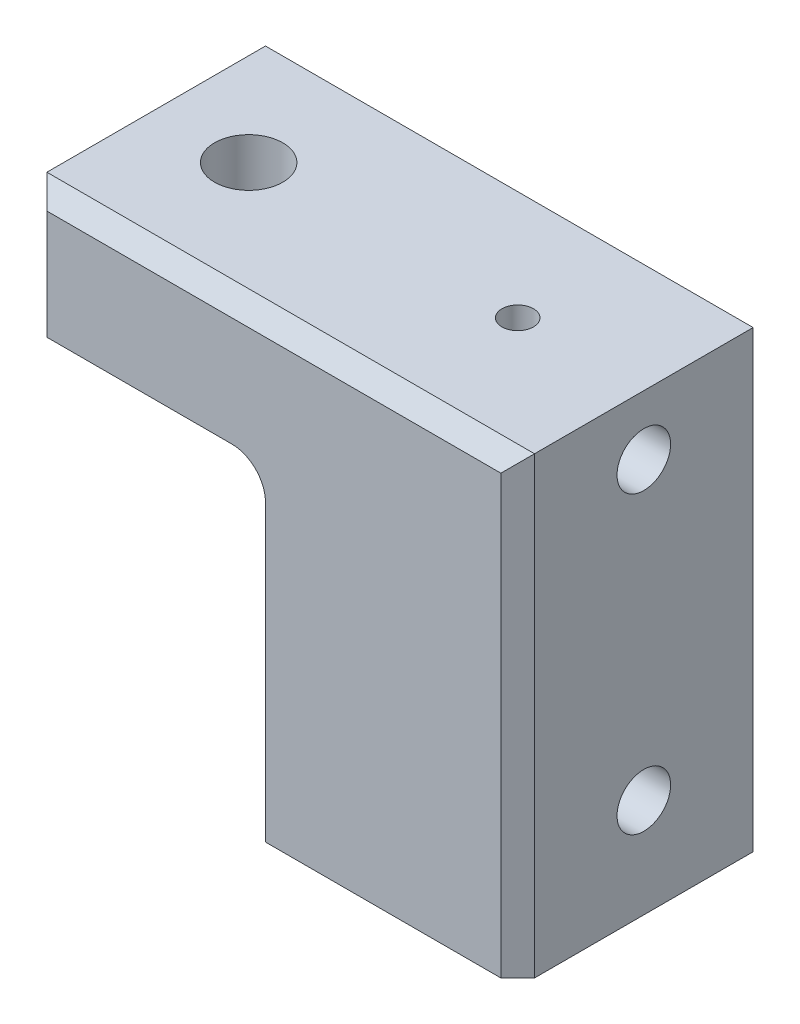
ISO-10303-21;
HEADER;
FILE_DESCRIPTION(('STEP AP214'),'2;1');
FILE_NAME('part.step','',(''),(''),'','','');
FILE_SCHEMA(('AUTOMOTIVE_DESIGN { 1 0 10303 214 1 1 1 1 }'));
ENDSEC;
DATA;
#1=APPLICATION_CONTEXT('core data for automotive mechanical design processes');
#2=APPLICATION_PROTOCOL_DEFINITION('international standard','automotive_design',2000,#1);
#3=PRODUCT_CONTEXT('',#1,'mechanical');
#4=PRODUCT('Part','Part','',(#3));
#5=PRODUCT_RELATED_PRODUCT_CATEGORY('part','',(#4));
#6=PRODUCT_DEFINITION_FORMATION('','',#4);
#7=PRODUCT_DEFINITION_CONTEXT('part definition',#1,'design');
#8=PRODUCT_DEFINITION('design','',#6,#7);
#9=PRODUCT_DEFINITION_SHAPE('','',#8);
#10=(LENGTH_UNIT() NAMED_UNIT(*) SI_UNIT(.MILLI.,.METRE.));
#11=(NAMED_UNIT(*) PLANE_ANGLE_UNIT() SI_UNIT($,.RADIAN.));
#12=(NAMED_UNIT(*) SI_UNIT($,.STERADIAN.) SOLID_ANGLE_UNIT());
#13=UNCERTAINTY_MEASURE_WITH_UNIT(LENGTH_MEASURE(1.E-05),#10,'distance_accuracy_value','');
#14=(GEOMETRIC_REPRESENTATION_CONTEXT(3) GLOBAL_UNCERTAINTY_ASSIGNED_CONTEXT((#13)) GLOBAL_UNIT_ASSIGNED_CONTEXT((#10,
#11,#12)) REPRESENTATION_CONTEXT('',''));
#15=CARTESIAN_POINT('',(0.,0.,0.));
#16=DIRECTION('',(0.,0.,1.));
#17=DIRECTION('',(1.,0.,0.));
#18=AXIS2_PLACEMENT_3D('',#15,#16,#17);
#19=CARTESIAN_POINT('',(-38.1,49.53,38.1));
#20=DIRECTION('',(0.,1.,0.));
#21=DIRECTION('',(0.,0.,1.));
#22=AXIS2_PLACEMENT_3D('',#19,#20,#21);
#23=PLANE('',#22);
#24=CARTESIAN_POINT('',(-59.69,49.53,19.05));
#25=DIRECTION('',(0.,1.,0.));
#26=DIRECTION('',(0.,0.,1.));
#27=AXIS2_PLACEMENT_3D('',#24,#25,#26);
#28=CIRCLE('',#27,5.15873999999998);
#29=CARTESIAN_POINT('',(-59.69,49.53,24.20874));
#30=VERTEX_POINT('',#29);
#31=EDGE_CURVE('E159',#30,#30,#28,.T.);
#32=ORIENTED_EDGE('',*,*,#31,.T.);
#33=EDGE_LOOP('',(#32));
#34=FACE_BOUND('',#33,.T.);
#35=DIRECTION('',(0.,0.,-1.));
#36=VECTOR('',#35,1.);
#37=CARTESIAN_POINT('',(-73.66,49.53,38.1));
#38=LINE('',#37,#36);
#39=CARTESIAN_POINT('',(-73.66,49.53,35.56));
#40=VERTEX_POINT('',#39);
#41=CARTESIAN_POINT('',(-73.66,49.53,2.54));
#42=VERTEX_POINT('',#41);
#43=EDGE_CURVE('E170',#40,#42,#38,.T.);
#44=ORIENTED_EDGE('',*,*,#43,.T.);
#45=DIRECTION('',(0.707106781186549,0.,-0.707106781186546));
#46=VECTOR('',#45,1.);
#47=CARTESIAN_POINT('',(-73.66,49.53,2.54));
#48=LINE('',#47,#46);
#49=CARTESIAN_POINT('',(-71.12,49.53,0.));
#50=VERTEX_POINT('',#49);
#51=EDGE_CURVE('E208',#42,#50,#48,.T.);
#52=ORIENTED_EDGE('',*,*,#51,.T.);
#53=DIRECTION('',(1.,0.,0.));
#54=VECTOR('',#53,1.);
#55=CARTESIAN_POINT('',(-38.1,49.53,0.));
#56=LINE('',#55,#54);
#57=CARTESIAN_POINT('',(-43.18,49.53,0.));
#58=VERTEX_POINT('',#57);
#59=EDGE_CURVE('E162',#50,#58,#56,.T.);
#60=ORIENTED_EDGE('',*,*,#59,.T.);
#61=DIRECTION('',(0.,0.,-1.));
#62=VECTOR('',#61,1.);
#63=CARTESIAN_POINT('',(-43.18,49.53,38.1));
#64=LINE('',#63,#62);
#65=CARTESIAN_POINT('',(-43.18,49.53,38.1));
#66=VERTEX_POINT('',#65);
#67=EDGE_CURVE('E193',#58,#66,#64,.F.);
#68=ORIENTED_EDGE('',*,*,#67,.T.);
#69=DIRECTION('',(1.,0.,0.));
#70=VECTOR('',#69,1.);
#71=CARTESIAN_POINT('',(-38.1,49.53,38.1));
#72=LINE('',#71,#70);
#73=CARTESIAN_POINT('',(-71.12,49.53,38.1));
#74=VERTEX_POINT('',#73);
#75=EDGE_CURVE('E163',#74,#66,#72,.T.);
#76=ORIENTED_EDGE('',*,*,#75,.F.);
#77=DIRECTION('',(0.707106781186546,0.,0.707106781186549));
#78=VECTOR('',#77,1.);
#79=CARTESIAN_POINT('',(-71.12,49.53,38.1));
#80=LINE('',#79,#78);
#81=EDGE_CURVE('E206',#74,#40,#80,.F.);
#82=ORIENTED_EDGE('',*,*,#81,.T.);
#83=EDGE_LOOP('',(#44,#52,#60,#68,#76,#82));
#84=FACE_BOUND('',#83,.T.);
#85=ADVANCED_FACE('F44',(#34,#84),#23,.F.);
#86=CARTESIAN_POINT('',(-38.1,0.,38.1));
#87=DIRECTION('',(1.,0.,0.));
#88=DIRECTION('',(0.,0.,-1.));
#89=AXIS2_PLACEMENT_3D('',#86,#87,#88);
#90=PLANE('',#89);
#91=CARTESIAN_POINT('',(-38.1,14.986,19.05));
#92=DIRECTION('',(1.,0.,0.));
#93=DIRECTION('',(0.,0.,-1.));
#94=AXIS2_PLACEMENT_3D('',#91,#92,#93);
#95=CIRCLE('',#94,3.37819999999999);
#96=CARTESIAN_POINT('',(-38.1,14.986,15.6718));
#97=VERTEX_POINT('',#96);
#98=EDGE_CURVE('E140',#97,#97,#95,.T.);
#99=ORIENTED_EDGE('',*,*,#98,.T.);
#100=EDGE_LOOP('',(#99));
#101=FACE_BOUND('',#100,.T.);
#102=DIRECTION('',(0.,-1.,0.));
#103=VECTOR('',#102,1.);
#104=CARTESIAN_POINT('',(-38.1,0.,38.1));
#105=LINE('',#104,#103);
#106=CARTESIAN_POINT('',(-38.1,44.45,38.1));
#107=VERTEX_POINT('',#106);
#108=CARTESIAN_POINT('',(-38.1,0.,38.1));
#109=VERTEX_POINT('',#108);
#110=EDGE_CURVE('E165',#107,#109,#105,.T.);
#111=ORIENTED_EDGE('',*,*,#110,.F.);
#112=DIRECTION('',(0.,0.,-1.));
#113=VECTOR('',#112,1.);
#114=CARTESIAN_POINT('',(-38.1,44.45,0.));
#115=LINE('',#114,#113);
#116=CARTESIAN_POINT('',(-38.1,44.45,0.));
#117=VERTEX_POINT('',#116);
#118=EDGE_CURVE('E189',#107,#117,#115,.T.);
#119=ORIENTED_EDGE('',*,*,#118,.T.);
#120=DIRECTION('',(0.,-1.,0.));
#121=VECTOR('',#120,1.);
#122=CARTESIAN_POINT('',(-38.1,0.,0.));
#123=LINE('',#122,#121);
#124=CARTESIAN_POINT('',(-38.1,0.,0.));
#125=VERTEX_POINT('',#124);
#126=EDGE_CURVE('E172',#117,#125,#123,.T.);
#127=ORIENTED_EDGE('',*,*,#126,.T.);
#128=DIRECTION('',(0.,0.,-1.));
#129=VECTOR('',#128,1.);
#130=CARTESIAN_POINT('',(-38.1,0.,38.1));
#131=LINE('',#130,#129);
#132=EDGE_CURVE('E187',#109,#125,#131,.T.);
#133=ORIENTED_EDGE('',*,*,#132,.F.);
#134=EDGE_LOOP('',(#111,#119,#127,#133));
#135=FACE_BOUND('',#134,.T.);
#136=ADVANCED_FACE('F298',(#101,#135),#90,.F.);
#137=CARTESIAN_POINT('',(0.,0.,38.1));
#138=DIRECTION('',(0.,1.,0.));
#139=DIRECTION('',(-1.,0.,0.));
#140=AXIS2_PLACEMENT_3D('',#137,#138,#139);
#141=PLANE('',#140);
#142=DIRECTION('',(1.,0.,0.));
#143=VECTOR('',#142,1.);
#144=CARTESIAN_POINT('',(0.,0.,0.));
#145=LINE('',#144,#143);
#146=CARTESIAN_POINT('',(-2.54000000000001,0.,0.));
#147=VERTEX_POINT('',#146);
#148=EDGE_CURVE('E166',#125,#147,#145,.T.);
#149=ORIENTED_EDGE('',*,*,#148,.T.);
#150=DIRECTION('',(0.707106781186549,0.,0.707106781186546));
#151=VECTOR('',#150,1.);
#152=CARTESIAN_POINT('',(0.,0.,2.54));
#153=LINE('',#152,#151);
#154=CARTESIAN_POINT('',(0.,0.,2.54000000000001));
#155=VERTEX_POINT('',#154);
#156=EDGE_CURVE('E222',#147,#155,#153,.T.);
#157=ORIENTED_EDGE('',*,*,#156,.T.);
#158=DIRECTION('',(0.,0.,-1.));
#159=VECTOR('',#158,1.);
#160=CARTESIAN_POINT('',(0.,0.,38.1));
#161=LINE('',#160,#159);
#162=CARTESIAN_POINT('',(0.,0.,35.56));
#163=VERTEX_POINT('',#162);
#164=EDGE_CURVE('E184',#163,#155,#161,.T.);
#165=ORIENTED_EDGE('',*,*,#164,.F.);
#166=DIRECTION('',(0.707106781186546,0.,-0.70710678118655));
#167=VECTOR('',#166,1.);
#168=CARTESIAN_POINT('',(-2.54,0.,38.1));
#169=LINE('',#168,#167);
#170=CARTESIAN_POINT('',(-2.54,0.,38.1));
#171=VERTEX_POINT('',#170);
#172=EDGE_CURVE('E220',#163,#171,#169,.F.);
#173=ORIENTED_EDGE('',*,*,#172,.T.);
#174=DIRECTION('',(1.,0.,0.));
#175=VECTOR('',#174,1.);
#176=CARTESIAN_POINT('',(0.,0.,38.1));
#177=LINE('',#176,#175);
#178=EDGE_CURVE('E168',#109,#171,#177,.T.);
#179=ORIENTED_EDGE('',*,*,#178,.F.);
#180=ORIENTED_EDGE('',*,*,#132,.T.);
#181=EDGE_LOOP('',(#149,#157,#165,#173,#179,#180));
#182=FACE_BOUND('',#181,.T.);
#183=ADVANCED_FACE('F254',(#182),#141,.F.);
#184=CARTESIAN_POINT('',(0.,68.58,38.1));
#185=DIRECTION('',(-1.,0.,0.));
#186=DIRECTION('',(0.,-1.,0.));
#187=AXIS2_PLACEMENT_3D('',#184,#185,#186);
#188=PLANE('',#187);
#189=CARTESIAN_POINT('',(0.,14.986,19.05));
#190=DIRECTION('',(1.,0.,0.));
#191=DIRECTION('',(0.,0.,-1.));
#192=AXIS2_PLACEMENT_3D('',#189,#190,#191);
#193=CIRCLE('',#192,4.04748999999999);
#194=CARTESIAN_POINT('',(0.,14.986,15.00251));
#195=VERTEX_POINT('',#194);
#196=EDGE_CURVE('E146',#195,#195,#193,.T.);
#197=ORIENTED_EDGE('',*,*,#196,.F.);
#198=EDGE_LOOP('',(#197));
#199=FACE_BOUND('',#198,.T.);
#200=CARTESIAN_POINT('',(1.2490009027033E-13,59.563,19.05));
#201=DIRECTION('',(1.,0.,0.));
#202=DIRECTION('',(0.,0.,-1.));
#203=AXIS2_PLACEMENT_3D('',#200,#201,#202);
#204=CIRCLE('',#203,4.04749000000004);
#205=CARTESIAN_POINT('',(1.2490009027033E-13,59.563,15.00251));
#206=VERTEX_POINT('',#205);
#207=EDGE_CURVE('E153',#206,#206,#204,.T.);
#208=ORIENTED_EDGE('',*,*,#207,.F.);
#209=EDGE_LOOP('',(#208));
#210=FACE_BOUND('',#209,.T.);
#211=ORIENTED_EDGE('',*,*,#164,.T.);
#212=DIRECTION('',(0.,1.,0.));
#213=VECTOR('',#212,1.);
#214=CARTESIAN_POINT('',(0.,68.58,2.54));
#215=LINE('',#214,#213);
#216=CARTESIAN_POINT('',(0.,68.58,2.54000000000001));
#217=VERTEX_POINT('',#216);
#218=EDGE_CURVE('E218',#155,#217,#215,.T.);
#219=ORIENTED_EDGE('',*,*,#218,.T.);
#220=DIRECTION('',(0.,0.,-1.));
#221=VECTOR('',#220,1.);
#222=CARTESIAN_POINT('',(0.,68.58,38.1));
#223=LINE('',#222,#221);
#224=CARTESIAN_POINT('',(0.,68.58,35.56));
#225=VERTEX_POINT('',#224);
#226=EDGE_CURVE('E181',#225,#217,#223,.T.);
#227=ORIENTED_EDGE('',*,*,#226,.F.);
#228=DIRECTION('',(0.,-1.,0.));
#229=VECTOR('',#228,1.);
#230=CARTESIAN_POINT('',(0.,68.58,35.56));
#231=LINE('',#230,#229);
#232=EDGE_CURVE('E216',#225,#163,#231,.T.);
#233=ORIENTED_EDGE('',*,*,#232,.T.);
#234=EDGE_LOOP('',(#211,#219,#227,#233));
#235=FACE_BOUND('',#234,.T.);
#236=ADVANCED_FACE('F251',(#199,#210,#235),#188,.F.);
#237=CARTESIAN_POINT('',(-73.66,68.58,38.1));
#238=DIRECTION('',(0.,-1.,0.));
#239=DIRECTION('',(0.,0.,-1.));
#240=AXIS2_PLACEMENT_3D('',#237,#238,#239);
#241=PLANE('',#240);
#242=CARTESIAN_POINT('',(-19.05,68.58,19.05));
#243=DIRECTION('',(0.,1.,0.));
#244=DIRECTION('',(0.,0.,1.));
#245=AXIS2_PLACEMENT_3D('',#242,#243,#244);
#246=CIRCLE('',#245,2.38124999999999);
#247=CARTESIAN_POINT('',(-19.05,68.58,21.43125));
#248=VERTEX_POINT('',#247);
#249=EDGE_CURVE('E235',#248,#248,#246,.T.);
#250=ORIENTED_EDGE('',*,*,#249,.F.);
#251=EDGE_LOOP('',(#250));
#252=FACE_BOUND('',#251,.T.);
#253=CARTESIAN_POINT('',(-59.69,68.58,19.05));
#254=DIRECTION('',(0.,1.,0.));
#255=DIRECTION('',(0.,0.,1.));
#256=AXIS2_PLACEMENT_3D('',#253,#254,#255);
#257=CIRCLE('',#256,5.15873999999999);
#258=CARTESIAN_POINT('',(-59.69,68.58,24.20874));
#259=VERTEX_POINT('',#258);
#260=EDGE_CURVE('E156',#259,#259,#257,.T.);
#261=ORIENTED_EDGE('',*,*,#260,.F.);
#262=EDGE_LOOP('',(#261));
#263=FACE_BOUND('',#262,.T.);
#264=ORIENTED_EDGE('',*,*,#226,.T.);
#265=DIRECTION('',(-1.,0.,0.));
#266=VECTOR('',#265,1.);
#267=CARTESIAN_POINT('',(-73.66,68.58,2.54));
#268=LINE('',#267,#266);
#269=CARTESIAN_POINT('',(-73.66,68.58,2.54000000000001));
#270=VERTEX_POINT('',#269);
#271=EDGE_CURVE('E226',#217,#270,#268,.T.);
#272=ORIENTED_EDGE('',*,*,#271,.T.);
#273=DIRECTION('',(0.,0.,-1.));
#274=VECTOR('',#273,1.);
#275=CARTESIAN_POINT('',(-73.66,68.58,38.1));
#276=LINE('',#275,#274);
#277=CARTESIAN_POINT('',(-73.66,68.58,35.56));
#278=VERTEX_POINT('',#277);
#279=EDGE_CURVE('E178',#278,#270,#276,.T.);
#280=ORIENTED_EDGE('',*,*,#279,.F.);
#281=DIRECTION('',(1.,0.,0.));
#282=VECTOR('',#281,1.);
#283=CARTESIAN_POINT('',(-73.66,68.58,35.56));
#284=LINE('',#283,#282);
#285=EDGE_CURVE('E224',#278,#225,#284,.T.);
#286=ORIENTED_EDGE('',*,*,#285,.T.);
#287=EDGE_LOOP('',(#264,#272,#280,#286));
#288=FACE_BOUND('',#287,.T.);
#289=ADVANCED_FACE('F264',(#252,#263,#288),#241,.F.);
#290=CARTESIAN_POINT('',(-73.66,49.53,38.1));
#291=DIRECTION('',(1.,0.,0.));
#292=DIRECTION('',(0.,0.,-1.));
#293=AXIS2_PLACEMENT_3D('',#290,#291,#292);
#294=PLANE('',#293);
#295=ORIENTED_EDGE('',*,*,#279,.T.);
#296=DIRECTION('',(0.,-1.,0.));
#297=VECTOR('',#296,1.);
#298=CARTESIAN_POINT('',(-73.66,49.53,2.54));
#299=LINE('',#298,#297);
#300=EDGE_CURVE('E203',#270,#42,#299,.T.);
#301=ORIENTED_EDGE('',*,*,#300,.T.);
#302=ORIENTED_EDGE('',*,*,#43,.F.);
#303=DIRECTION('',(0.,1.,0.));
#304=VECTOR('',#303,1.);
#305=CARTESIAN_POINT('',(-73.66,49.53,35.56));
#306=LINE('',#305,#304);
#307=EDGE_CURVE('E201',#40,#278,#306,.T.);
#308=ORIENTED_EDGE('',*,*,#307,.T.);
#309=EDGE_LOOP('',(#295,#301,#302,#308));
#310=FACE_BOUND('',#309,.T.);
#311=ADVANCED_FACE('F268',(#310),#294,.F.);
#312=CARTESIAN_POINT('',(-73.66,49.53,38.1));
#313=DIRECTION('',(0.,0.,-1.));
#314=DIRECTION('',(-1.,0.,0.));
#315=AXIS2_PLACEMENT_3D('',#312,#313,#314);
#316=PLANE('',#315);
#317=DIRECTION('',(-1.,0.,0.));
#318=VECTOR('',#317,1.);
#319=CARTESIAN_POINT('',(-73.66,66.04,38.1));
#320=LINE('',#319,#318);
#321=CARTESIAN_POINT('',(-2.54,66.04,38.1));
#322=VERTEX_POINT('',#321);
#323=CARTESIAN_POINT('',(-71.12,66.04,38.1));
#324=VERTEX_POINT('',#323);
#325=EDGE_CURVE('E60',#322,#324,#320,.T.);
#326=ORIENTED_EDGE('',*,*,#325,.T.);
#327=DIRECTION('',(0.,-1.,0.));
#328=VECTOR('',#327,1.);
#329=CARTESIAN_POINT('',(-71.12,49.53,38.1));
#330=LINE('',#329,#328);
#331=EDGE_CURVE('E13',#324,#74,#330,.T.);
#332=ORIENTED_EDGE('',*,*,#331,.T.);
#333=ORIENTED_EDGE('',*,*,#75,.T.);
#334=CARTESIAN_POINT('',(-43.18,44.45,38.1));
#335=DIRECTION('',(0.,0.,-1.));
#336=DIRECTION('',(-1.,0.,0.));
#337=AXIS2_PLACEMENT_3D('',#334,#335,#336);
#338=CIRCLE('',#337,5.08);
#339=EDGE_CURVE('E199',#66,#107,#338,.T.);
#340=ORIENTED_EDGE('',*,*,#339,.T.);
#341=ORIENTED_EDGE('',*,*,#110,.T.);
#342=ORIENTED_EDGE('',*,*,#178,.T.);
#343=DIRECTION('',(0.,1.,0.));
#344=VECTOR('',#343,1.);
#345=CARTESIAN_POINT('',(-2.54,49.53,38.1));
#346=LINE('',#345,#344);
#347=EDGE_CURVE('E53',#171,#322,#346,.T.);
#348=ORIENTED_EDGE('',*,*,#347,.T.);
#349=EDGE_LOOP('',(#326,#332,#333,#340,#341,#342,#348));
#350=FACE_BOUND('',#349,.T.);
#351=ADVANCED_FACE('F288',(#350),#316,.F.);
#352=CARTESIAN_POINT('',(-73.66,49.53,0.));
#353=DIRECTION('',(0.,0.,-1.));
#354=DIRECTION('',(-1.,0.,0.));
#355=AXIS2_PLACEMENT_3D('',#352,#353,#354);
#356=PLANE('',#355);
#357=ORIENTED_EDGE('',*,*,#59,.F.);
#358=DIRECTION('',(0.,1.,0.));
#359=VECTOR('',#358,1.);
#360=CARTESIAN_POINT('',(-71.12,68.58,0.));
#361=LINE('',#360,#359);
#362=CARTESIAN_POINT('',(-71.12,66.04,0.));
#363=VERTEX_POINT('',#362);
#364=EDGE_CURVE('E214',#50,#363,#361,.T.);
#365=ORIENTED_EDGE('',*,*,#364,.T.);
#366=DIRECTION('',(1.,0.,0.));
#367=VECTOR('',#366,1.);
#368=CARTESIAN_POINT('',(0.,66.04,0.));
#369=LINE('',#368,#367);
#370=CARTESIAN_POINT('',(-2.54000000000001,66.04,0.));
#371=VERTEX_POINT('',#370);
#372=EDGE_CURVE('E210',#363,#371,#369,.T.);
#373=ORIENTED_EDGE('',*,*,#372,.T.);
#374=DIRECTION('',(0.,-1.,0.));
#375=VECTOR('',#374,1.);
#376=CARTESIAN_POINT('',(-2.54000000000001,0.,0.));
#377=LINE('',#376,#375);
#378=EDGE_CURVE('E212',#371,#147,#377,.T.);
#379=ORIENTED_EDGE('',*,*,#378,.T.);
#380=ORIENTED_EDGE('',*,*,#148,.F.);
#381=ORIENTED_EDGE('',*,*,#126,.F.);
#382=CARTESIAN_POINT('',(-43.18,44.45,0.));
#383=DIRECTION('',(0.,0.,-1.));
#384=DIRECTION('',(-1.,0.,0.));
#385=AXIS2_PLACEMENT_3D('',#382,#383,#384);
#386=CIRCLE('',#385,5.08);
#387=EDGE_CURVE('E196',#117,#58,#386,.F.);
#388=ORIENTED_EDGE('',*,*,#387,.T.);
#389=EDGE_LOOP('',(#357,#365,#373,#379,#380,#381,#388));
#390=FACE_BOUND('',#389,.T.);
#391=ADVANCED_FACE('F280',(#390),#356,.T.);
#392=CARTESIAN_POINT('',(-59.69,68.58,19.05));
#393=DIRECTION('',(0.,1.,0.));
#394=DIRECTION('',(0.,0.,1.));
#395=AXIS2_PLACEMENT_3D('',#392,#393,#394);
#396=CYLINDRICAL_SURFACE('',#395,5.15873999999998);
#397=ORIENTED_EDGE('',*,*,#260,.T.);
#398=EDGE_LOOP('',(#397));
#399=FACE_BOUND('',#398,.T.);
#400=ORIENTED_EDGE('',*,*,#31,.F.);
#401=EDGE_LOOP('',(#400));
#402=FACE_BOUND('',#401,.T.);
#403=ADVANCED_FACE('F355',(#399,#402),#396,.F.);
#404=CARTESIAN_POINT('',(0.,59.563,19.05));
#405=DIRECTION('',(1.,0.,0.));
#406=DIRECTION('',(0.,0.,-1.));
#407=AXIS2_PLACEMENT_3D('',#404,#405,#406);
#408=CYLINDRICAL_SURFACE('',#407,4.04749000000004);
#409=CARTESIAN_POINT('',(-15.7479999999999,59.563,19.05));
#410=DIRECTION('',(1.,0.,0.));
#411=DIRECTION('',(0.,0.,-1.));
#412=AXIS2_PLACEMENT_3D('',#409,#410,#411);
#413=CIRCLE('',#412,4.04749000000004);
#414=CARTESIAN_POINT('',(-15.7479999999999,59.563,15.00251));
#415=VERTEX_POINT('',#414);
#416=EDGE_CURVE('E143',#415,#415,#413,.T.);
#417=ORIENTED_EDGE('',*,*,#416,.F.);
#418=EDGE_LOOP('',(#417));
#419=FACE_BOUND('',#418,.T.);
#420=ORIENTED_EDGE('',*,*,#207,.T.);
#421=EDGE_LOOP('',(#420));
#422=FACE_BOUND('',#421,.T.);
#423=ADVANCED_FACE('F352',(#419,#422),#408,.F.);
#424=CARTESIAN_POINT('',(-15.7479999999999,62.9412,19.05));
#425=DIRECTION('',(-1.,0.,0.));
#426=DIRECTION('',(0.,0.,1.));
#427=AXIS2_PLACEMENT_3D('',#424,#425,#426);
#428=PLANE('',#427);
#429=CARTESIAN_POINT('',(-15.748,59.563,19.05));
#430=DIRECTION('',(1.,0.,0.));
#431=DIRECTION('',(0.,0.,-1.));
#432=AXIS2_PLACEMENT_3D('',#429,#430,#431);
#433=CIRCLE('',#432,3.37819999999999);
#434=CARTESIAN_POINT('',(-15.748,59.563,15.6718));
#435=VERTEX_POINT('',#434);
#436=EDGE_CURVE('E139',#435,#435,#433,.T.);
#437=ORIENTED_EDGE('',*,*,#436,.F.);
#438=EDGE_LOOP('',(#437));
#439=FACE_BOUND('',#438,.T.);
#440=ORIENTED_EDGE('',*,*,#416,.T.);
#441=EDGE_LOOP('',(#440));
#442=FACE_BOUND('',#441,.T.);
#443=ADVANCED_FACE('F354',(#439,#442),#428,.F.);
#444=CARTESIAN_POINT('',(0.,59.563,19.05));
#445=DIRECTION('',(1.,0.,0.));
#446=DIRECTION('',(0.,0.,-1.));
#447=AXIS2_PLACEMENT_3D('',#444,#445,#446);
#448=CYLINDRICAL_SURFACE('',#447,3.37819999999999);
#449=CARTESIAN_POINT('',(-19.05,61.9592227937944,21.43125));
#450=CARTESIAN_POINT('',(-18.9359868720826,61.9592280928064,21.431247477135));
#451=CARTESIAN_POINT('',(-18.8219608591508,61.9675212767405,21.422985201558));
#452=CARTESIAN_POINT('',(-18.598157196441,61.9989098730898,21.3907359462089));
#453=CARTESIAN_POINT('',(-18.4883898728869,62.0220391375964,21.3667130018088));
#454=CARTESIAN_POINT('',(-18.2772067330058,62.0787138089649,21.3050235198922));
#455=CARTESIAN_POINT('',(-18.1757109006721,62.1121391924891,21.2675134022336));
#456=CARTESIAN_POINT('',(-17.980697616419,62.185425615349,21.1803433569552));
#457=CARTESIAN_POINT('',(-17.8871804649329,62.2252868968622,21.1306829720952));
#458=CARTESIAN_POINT('',(-17.6925339542891,62.3154310921772,21.0103461912306));
#459=CARTESIAN_POINT('',(-17.5930173985083,62.3663053893881,20.9375017660292));
#460=CARTESIAN_POINT('',(-17.4061852598383,62.4678010302935,20.7772544034519));
#461=CARTESIAN_POINT('',(-17.318885323687,62.5184219709583,20.6898331046531));
#462=CARTESIAN_POINT('',(-17.144121913988,62.6238169107056,20.4849215150611));
#463=CARTESIAN_POINT('',(-17.059151996863,62.677834696879,20.3648459902898));
#464=CARTESIAN_POINT('',(-16.9484221975752,62.7501225060885,20.1721474154032));
#465=CARTESIAN_POINT('',(-16.9143063942032,62.7727572715053,20.105835656106));
#466=CARTESIAN_POINT('',(-16.8521152448853,62.8144683183413,19.9693870760308));
#467=CARTESIAN_POINT('',(-16.8240372179877,62.8335461786293,19.8992519703453));
#468=CARTESIAN_POINT('',(-16.7631793468074,62.8752098606525,19.7230379357126));
#469=CARTESIAN_POINT('',(-16.7340511658575,62.8954567370399,19.6150950882327));
#470=CARTESIAN_POINT('',(-16.691184585026,62.925388705296,19.3948419853431));
#471=CARTESIAN_POINT('',(-16.6774337956266,62.9350822997449,19.2825353214539));
#472=CARTESIAN_POINT('',(-16.6660665479795,62.9430894757941,19.0564569214681));
#473=CARTESIAN_POINT('',(-16.6684823968711,62.9413802702507,18.942682705491));
#474=CARTESIAN_POINT('',(-16.6893826382428,62.9266801519502,18.7173602169598));
#475=CARTESIAN_POINT('',(-16.7078714473176,62.9136861383077,18.6058125648492));
#476=CARTESIAN_POINT('',(-16.7592416380691,62.8779852860746,18.3906605320209));
#477=CARTESIAN_POINT('',(-16.791768631601,62.8555179012333,18.2869300508153));
#478=CARTESIAN_POINT('',(-16.8696695061326,62.8025848318667,18.0866358062155));
#479=CARTESIAN_POINT('',(-16.9150459389015,62.7721175587317,17.9900734711553));
#480=CARTESIAN_POINT('',(-17.0228450572977,62.7013753370535,17.7951056443661));
#481=CARTESIAN_POINT('',(-17.0866078993159,62.6603840331723,17.6977055090802));
#482=CARTESIAN_POINT('',(-17.2263798699337,62.5737250314087,17.5143982572079));
#483=CARTESIAN_POINT('',(-17.3024019331859,62.5280524130448,17.4285034570359));
#484=CARTESIAN_POINT('',(-17.4801243166559,62.4265846294546,17.2544504397976));
#485=CARTESIAN_POINT('',(-17.5839824781237,62.3704513247328,17.1686864594776));
#486=CARTESIAN_POINT('',(-17.8057887571774,62.2612615874545,17.0151845468978));
#487=CARTESIAN_POINT('',(-17.9237342020089,62.2082045740677,16.9474432030832));
#488=CARTESIAN_POINT('',(-18.144224901695,62.1231779635,16.845211910497));
#489=CARTESIAN_POINT('',(-18.2440842307621,62.0891640112659,16.8066582746151));
#490=CARTESIAN_POINT('',(-18.4506677509394,62.03105830398,16.7428819262216));
#491=CARTESIAN_POINT('',(-18.5573786934138,62.0069480292789,16.7176343065011));
#492=CARTESIAN_POINT('',(-18.7767290416452,61.9723112773871,16.681853389826));
#493=CARTESIAN_POINT('',(-18.8894193505781,61.9619316955874,16.6714791158505));
#494=CARTESIAN_POINT('',(-19.1154340281401,61.9574582909583,16.6669714108191));
#495=CARTESIAN_POINT('',(-19.2287580707002,61.9633567464902,16.6728302794257));
#496=CARTESIAN_POINT('',(-19.4353043935472,61.9881454559289,16.6981644230112));
#497=CARTESIAN_POINT('',(-19.5290537929948,62.0050221447948,16.7155361578057));
#498=CARTESIAN_POINT('',(-19.7120037402152,62.0473910515487,16.7606781662039));
#499=CARTESIAN_POINT('',(-19.801199195473,62.0728926816077,16.7884598034488));
#500=CARTESIAN_POINT('',(-20.0150758563549,62.1434513908319,16.8688228354442));
#501=CARTESIAN_POINT('',(-20.1365142498931,62.1920459813543,16.9269167227828));
#502=CARTESIAN_POINT('',(-20.3663137886686,62.2950282756878,17.0611708449682));
#503=CARTESIAN_POINT('',(-20.4746484922952,62.3494272893286,17.1373667188969));
#504=CARTESIAN_POINT('',(-20.6793433644694,62.4593888297346,17.3082459960059));
#505=CARTESIAN_POINT('',(-20.775418613763,62.5149527363278,17.4032706516287));
#506=CARTESIAN_POINT('',(-20.9511618445605,62.6210073723977,17.6097695903521));
#507=CARTESIAN_POINT('',(-21.0308534031849,62.6715053376803,17.7212198335454));
#508=CARTESIAN_POINT('',(-21.1601833154588,62.7556089202348,17.9404821318633));
#509=CARTESIAN_POINT('',(-21.2125750182431,62.790621769709,18.0461225157759));
#510=CARTESIAN_POINT('',(-21.3017585657345,62.8510421032765,18.2664029277278));
#511=CARTESIAN_POINT('',(-21.3385596923058,62.8764553015521,18.3810375527161));
#512=CARTESIAN_POINT('',(-21.3947559309024,62.9155141200171,18.6172397364912));
#513=CARTESIAN_POINT('',(-21.4140465711951,62.9290890919006,18.7388443639521));
#514=CARTESIAN_POINT('',(-21.433521180577,62.9427936725869,18.9843178580704));
#515=CARTESIAN_POINT('',(-21.4337134677877,62.942929134851,19.1081857154857));
#516=CARTESIAN_POINT('',(-21.415958464931,62.9304345002557,19.3413422515797));
#517=CARTESIAN_POINT('',(-21.3998291242472,62.9190837669709,19.4508468253111));
#518=CARTESIAN_POINT('',(-21.3530360526079,62.8864887541085,19.6651511559657));
#519=CARTESIAN_POINT('',(-21.322369647749,62.86524265442,19.7699500434554));
#520=CARTESIAN_POINT('',(-21.2467604142127,62.8136694844358,19.9757396891477));
#521=CARTESIAN_POINT('',(-21.2014028516061,62.7830802957168,20.0765103195781));
#522=CARTESIAN_POINT('',(-21.0984465523174,62.7152246033632,20.2690789661267));
#523=CARTESIAN_POINT('',(-21.0408455201435,62.6779568477898,20.3608752949613));
#524=CARTESIAN_POINT('',(-20.905063525534,62.5928367276425,20.5481585531637));
#525=CARTESIAN_POINT('',(-20.8250745766538,62.5442398350384,20.6419939479566));
#526=CARTESIAN_POINT('',(-20.6522527949241,62.4446839154399,20.8158425839427));
#527=CARTESIAN_POINT('',(-20.559394105204,62.3937202739669,20.8958272507944));
#528=CARTESIAN_POINT('',(-20.3458092550534,62.2853408433878,21.0528930603534));
#529=CARTESIAN_POINT('',(-20.2230070629333,62.2282240025292,21.1273855323431));
#530=CARTESIAN_POINT('',(-19.9624955831778,62.1243289094772,21.2542129473783));
#531=CARTESIAN_POINT('',(-19.8248267601957,62.0775235976117,21.3066062224863));
#532=CARTESIAN_POINT('',(-19.5801308452393,62.0152343049046,21.3738406705929));
#533=CARTESIAN_POINT('',(-19.4762525509159,61.9945694981225,21.395226265156));
#534=CARTESIAN_POINT('',(-19.26491444596,61.9665757483344,21.4239168047621));
#535=CARTESIAN_POINT('',(-19.1574629464931,61.9592177992166,21.4312523779236));
#536=CARTESIAN_POINT('',(-19.05,61.9592227937944,21.43125));
#537=B_SPLINE_CURVE_WITH_KNOTS('',3,(#449,#450,#451,#452,#453,#454,#455,#456,#457,#458,#459,
#460,#461,#462,#463,#464,#465,#466,#467,#468,#469,#470,#471,#472,#473,#474,#475,#476,#477,#478,
#479,#480,#481,#482,#483,#484,#485,#486,#487,#488,#489,#490,#491,#492,#493,#494,#495,#496,#497,
#498,#499,#500,#501,#502,#503,#504,#505,#506,#507,#508,#509,#510,#511,#512,#513,#514,#515,#516,
#517,#518,#519,#520,#521,#522,#523,#524,#525,#526,#527,#528,#529,#530,#531,#532,#533,#534,#535,
#536),.UNSPECIFIED.,.T.,.F.,(4,2,2,2,2,2,2,2,2,2,2,2,2,2,2,2,2,2,2,2,2,2,2,2,2,2,2,2,2,2,2,2,2,
2,2,2,2,2,2,2,2,2,2,4),(0.,0.341528344917512,0.683838754551176,1.02230085015821,1.3607756847707,
1.75956198597454,2.15885445732936,2.62600486195141,2.85946016793797,3.09281159781292,
3.43209288026421,3.77110060742085,4.11078600396671,4.45056477018715,4.78222627887781,
5.11395369844707,5.48284317263384,5.85212443822909,6.2881163106606,6.72402559416768,
7.05980312945682,7.39494987822912,7.73365389297332,8.07219726792958,8.36151971950441,
8.65115892527621,9.07822263413089,9.50613421494072,9.9426589436462,10.3785510205677,
10.7460674311192,11.1133647318949,11.4828392813846,11.8521529087441,12.1844144999874,
12.5167372301456,12.8594058913591,13.2021388552623,13.5982462095496,13.9951612503693,
14.4566402361419,14.9168933818811,15.2395046174755,15.5614117778713),.UNSPECIFIED.);
#538=CARTESIAN_POINT('',(-19.05,61.9592227937944,21.43125));
#539=VERTEX_POINT('',#538);
#540=EDGE_CURVE('E330',#539,#539,#537,.T.);
#541=ORIENTED_EDGE('',*,*,#540,.T.);
#542=EDGE_LOOP('',(#541));
#543=FACE_BOUND('',#542,.T.);
#544=CARTESIAN_POINT('',(-22.86,59.563,19.05));
#545=DIRECTION('',(1.,0.,0.));
#546=DIRECTION('',(0.,0.,-1.));
#547=AXIS2_PLACEMENT_3D('',#544,#545,#546);
#548=CIRCLE('',#547,3.37819999999999);
#549=CARTESIAN_POINT('',(-22.86,59.563,15.6718));
#550=VERTEX_POINT('',#549);
#551=EDGE_CURVE('E137',#550,#550,#548,.T.);
#552=ORIENTED_EDGE('',*,*,#551,.F.);
#553=EDGE_LOOP('',(#552));
#554=FACE_BOUND('',#553,.T.);
#555=ORIENTED_EDGE('',*,*,#436,.T.);
#556=EDGE_LOOP('',(#555));
#557=FACE_BOUND('',#556,.T.);
#558=ADVANCED_FACE('F133',(#543,#554,#557),#448,.F.);
#559=CARTESIAN_POINT('',(-22.86,59.563,19.05));
#560=DIRECTION('',(1.,0.,0.));
#561=DIRECTION('',(0.,0.,-1.));
#562=AXIS2_PLACEMENT_3D('',#559,#560,#561);
#563=CONICAL_SURFACE('',#562,3.37819999999999,1.02974425867665);
#564=CARTESIAN_POINT('',(-24.8898273431989,59.563,19.05));
#565=VERTEX_POINT('',#564);
#566=VERTEX_LOOP('',#565);
#567=FACE_BOUND('',#566,.T.);
#568=ORIENTED_EDGE('',*,*,#551,.T.);
#569=EDGE_LOOP('',(#568));
#570=FACE_BOUND('',#569,.T.);
#571=ADVANCED_FACE('F129',(#567,#570),#563,.F.);
#572=CARTESIAN_POINT('',(0.,14.986,19.05));
#573=DIRECTION('',(1.,0.,0.));
#574=DIRECTION('',(0.,0.,-1.));
#575=AXIS2_PLACEMENT_3D('',#572,#573,#574);
#576=CYLINDRICAL_SURFACE('',#575,3.37819999999999);
#577=CARTESIAN_POINT('',(-15.748,14.986,19.05));
#578=DIRECTION('',(1.,0.,0.));
#579=DIRECTION('',(0.,0.,-1.));
#580=AXIS2_PLACEMENT_3D('',#577,#578,#579);
#581=CIRCLE('',#580,3.3782);
#582=CARTESIAN_POINT('',(-15.748,14.986,15.6718));
#583=VERTEX_POINT('',#582);
#584=EDGE_CURVE('E336',#583,#583,#581,.T.);
#585=ORIENTED_EDGE('',*,*,#584,.T.);
#586=EDGE_LOOP('',(#585));
#587=FACE_BOUND('',#586,.T.);
#588=ORIENTED_EDGE('',*,*,#98,.F.);
#589=EDGE_LOOP('',(#588));
#590=FACE_BOUND('',#589,.T.);
#591=ADVANCED_FACE('F132',(#587,#590),#576,.F.);
#592=CARTESIAN_POINT('',(0.,14.986,19.05));
#593=DIRECTION('',(1.,0.,0.));
#594=DIRECTION('',(0.,0.,-1.));
#595=AXIS2_PLACEMENT_3D('',#592,#593,#594);
#596=CYLINDRICAL_SURFACE('',#595,4.04748999999999);
#597=CARTESIAN_POINT('',(-15.748,14.986,19.05));
#598=DIRECTION('',(1.,0.,0.));
#599=DIRECTION('',(0.,0.,-1.));
#600=AXIS2_PLACEMENT_3D('',#597,#598,#599);
#601=CIRCLE('',#600,4.04748999999999);
#602=CARTESIAN_POINT('',(-15.748,14.986,15.00251));
#603=VERTEX_POINT('',#602);
#604=EDGE_CURVE('E338',#603,#603,#601,.T.);
#605=ORIENTED_EDGE('',*,*,#604,.F.);
#606=EDGE_LOOP('',(#605));
#607=FACE_BOUND('',#606,.T.);
#608=ORIENTED_EDGE('',*,*,#196,.T.);
#609=EDGE_LOOP('',(#608));
#610=FACE_BOUND('',#609,.T.);
#611=ADVANCED_FACE('F345',(#607,#610),#596,.F.);
#612=CARTESIAN_POINT('',(-15.748,18.3642,19.05));
#613=DIRECTION('',(-1.,0.,0.));
#614=DIRECTION('',(0.,0.,1.));
#615=AXIS2_PLACEMENT_3D('',#612,#613,#614);
#616=PLANE('',#615);
#617=ORIENTED_EDGE('',*,*,#584,.F.);
#618=EDGE_LOOP('',(#617));
#619=FACE_BOUND('',#618,.T.);
#620=ORIENTED_EDGE('',*,*,#604,.T.);
#621=EDGE_LOOP('',(#620));
#622=FACE_BOUND('',#621,.T.);
#623=ADVANCED_FACE('F311',(#619,#622),#616,.F.);
#624=CARTESIAN_POINT('',(-43.18,44.45,38.1));
#625=DIRECTION('',(0.,0.,1.));
#626=DIRECTION('',(1.,0.,0.));
#627=AXIS2_PLACEMENT_3D('',#624,#625,#626);
#628=CYLINDRICAL_SURFACE('',#627,5.08);
#629=ORIENTED_EDGE('',*,*,#339,.F.);
#630=ORIENTED_EDGE('',*,*,#67,.F.);
#631=ORIENTED_EDGE('',*,*,#387,.F.);
#632=ORIENTED_EDGE('',*,*,#118,.F.);
#633=EDGE_LOOP('',(#629,#630,#631,#632));
#634=FACE_BOUND('',#633,.T.);
#635=ADVANCED_FACE('F286',(#634),#628,.F.);
#636=CARTESIAN_POINT('',(-19.05,68.58,19.05));
#637=DIRECTION('',(0.,1.,0.));
#638=DIRECTION('',(0.,0.,1.));
#639=AXIS2_PLACEMENT_3D('',#636,#637,#638);
#640=CYLINDRICAL_SURFACE('',#639,2.38124999999999);
#641=ORIENTED_EDGE('',*,*,#540,.F.);
#642=EDGE_LOOP('',(#641));
#643=FACE_BOUND('',#642,.T.);
#644=ORIENTED_EDGE('',*,*,#249,.T.);
#645=EDGE_LOOP('',(#644));
#646=FACE_BOUND('',#645,.T.);
#647=ADVANCED_FACE('F310',(#643,#646),#640,.F.);
#648=CARTESIAN_POINT('',(0.,68.58,2.54));
#649=DIRECTION('',(0.707106781186546,0.,-0.707106781186549));
#650=DIRECTION('',(-0.707106781186549,0.,-0.707106781186546));
#651=AXIS2_PLACEMENT_3D('',#648,#649,#650);
#652=PLANE('',#651);
#653=ORIENTED_EDGE('',*,*,#156,.F.);
#654=ORIENTED_EDGE('',*,*,#378,.F.);
#655=DIRECTION('',(-0.577350269189627,-0.577350269189627,-0.577350269189624));
#656=VECTOR('',#655,1.);
#657=CARTESIAN_POINT('',(-24.5533333333334,44.0266666666666,-22.0133333333333));
#658=LINE('',#657,#656);
#659=EDGE_CURVE('E233',#217,#371,#658,.T.);
#660=ORIENTED_EDGE('',*,*,#659,.F.);
#661=ORIENTED_EDGE('',*,*,#218,.F.);
#662=EDGE_LOOP('',(#653,#654,#660,#661));
#663=FACE_BOUND('',#662,.T.);
#664=ADVANCED_FACE('F260',(#663),#652,.T.);
#665=CARTESIAN_POINT('',(-73.66,68.58,2.54));
#666=DIRECTION('',(0.,0.707106781186546,-0.70710678118655));
#667=DIRECTION('',(0.,0.70710678118655,0.707106781186546));
#668=AXIS2_PLACEMENT_3D('',#665,#666,#667);
#669=PLANE('',#668);
#670=ORIENTED_EDGE('',*,*,#659,.T.);
#671=ORIENTED_EDGE('',*,*,#372,.F.);
#672=DIRECTION('',(-0.577350269189627,0.577350269189627,0.577350269189624));
#673=VECTOR('',#672,1.);
#674=CARTESIAN_POINT('',(-73.66,68.58,2.54));
#675=LINE('',#674,#673);
#676=EDGE_CURVE('E230',#270,#363,#675,.F.);
#677=ORIENTED_EDGE('',*,*,#676,.F.);
#678=ORIENTED_EDGE('',*,*,#271,.F.);
#679=EDGE_LOOP('',(#670,#671,#677,#678));
#680=FACE_BOUND('',#679,.T.);
#681=ADVANCED_FACE('F273',(#680),#669,.T.);
#682=CARTESIAN_POINT('',(-73.66,49.53,2.54));
#683=DIRECTION('',(-0.707106781186546,0.,-0.70710678118655));
#684=DIRECTION('',(-0.70710678118655,0.,0.707106781186546));
#685=AXIS2_PLACEMENT_3D('',#682,#683,#684);
#686=PLANE('',#685);
#687=ORIENTED_EDGE('',*,*,#676,.T.);
#688=ORIENTED_EDGE('',*,*,#364,.F.);
#689=ORIENTED_EDGE('',*,*,#51,.F.);
#690=ORIENTED_EDGE('',*,*,#300,.F.);
#691=EDGE_LOOP('',(#687,#688,#689,#690));
#692=FACE_BOUND('',#691,.T.);
#693=ADVANCED_FACE('F276',(#692),#686,.T.);
#694=CARTESIAN_POINT('',(-2.54,49.53,38.1));
#695=DIRECTION('',(-0.70710678118655,0.,-0.707106781186546));
#696=DIRECTION('',(-0.707106781186546,0.,0.70710678118655));
#697=AXIS2_PLACEMENT_3D('',#694,#695,#696);
#698=PLANE('',#697);
#699=ORIENTED_EDGE('',*,*,#172,.F.);
#700=ORIENTED_EDGE('',*,*,#232,.F.);
#701=DIRECTION('',(0.577350269189625,0.577350269189625,-0.577350269189628));
#702=VECTOR('',#701,1.);
#703=CARTESIAN_POINT('',(-26.2466666666666,42.3333333333334,61.8066666666667));
#704=LINE('',#703,#702);
#705=EDGE_CURVE('E48',#322,#225,#704,.T.);
#706=ORIENTED_EDGE('',*,*,#705,.F.);
#707=ORIENTED_EDGE('',*,*,#347,.F.);
#708=EDGE_LOOP('',(#699,#700,#706,#707));
#709=FACE_BOUND('',#708,.T.);
#710=ADVANCED_FACE('F46',(#709),#698,.F.);
#711=CARTESIAN_POINT('',(-73.66,66.04,38.1));
#712=DIRECTION('',(0.,-0.70710678118655,-0.707106781186546));
#713=DIRECTION('',(0.,0.707106781186546,-0.70710678118655));
#714=AXIS2_PLACEMENT_3D('',#711,#712,#713);
#715=PLANE('',#714);
#716=ORIENTED_EDGE('',*,*,#705,.T.);
#717=ORIENTED_EDGE('',*,*,#285,.F.);
#718=DIRECTION('',(0.577350269189625,-0.577350269189625,0.577350269189628));
#719=VECTOR('',#718,1.);
#720=CARTESIAN_POINT('',(-71.9666666666667,66.8866666666667,37.2533333333333));
#721=LINE('',#720,#719);
#722=EDGE_CURVE('E236',#324,#278,#721,.F.);
#723=ORIENTED_EDGE('',*,*,#722,.F.);
#724=ORIENTED_EDGE('',*,*,#325,.F.);
#725=EDGE_LOOP('',(#716,#717,#723,#724));
#726=FACE_BOUND('',#725,.T.);
#727=ADVANCED_FACE('F244',(#726),#715,.F.);
#728=CARTESIAN_POINT('',(-71.12,49.53,38.1));
#729=DIRECTION('',(0.70710678118655,0.,-0.707106781186546));
#730=DIRECTION('',(-0.707106781186546,0.,-0.70710678118655));
#731=AXIS2_PLACEMENT_3D('',#728,#729,#730);
#732=PLANE('',#731);
#733=ORIENTED_EDGE('',*,*,#722,.T.);
#734=ORIENTED_EDGE('',*,*,#307,.F.);
#735=ORIENTED_EDGE('',*,*,#81,.F.);
#736=ORIENTED_EDGE('',*,*,#331,.F.);
#737=EDGE_LOOP('',(#733,#734,#735,#736));
#738=FACE_BOUND('',#737,.T.);
#739=ADVANCED_FACE('F290',(#738),#732,.F.);
#740=CLOSED_SHELL('',(#85,#136,#183,#236,#289,#311,#351,#391,#403,#423,#443,#558,#571,#591,#611,
#623,#635,#647,#664,#681,#693,#710,#727,#739));
#741=MANIFOLD_SOLID_BREP('B2',#740);
#742=ADVANCED_BREP_SHAPE_REPRESENTATION('',(#18,#741),#14);
#743=SHAPE_DEFINITION_REPRESENTATION(#9,#742);
ENDSEC;
END-ISO-10303-21;
